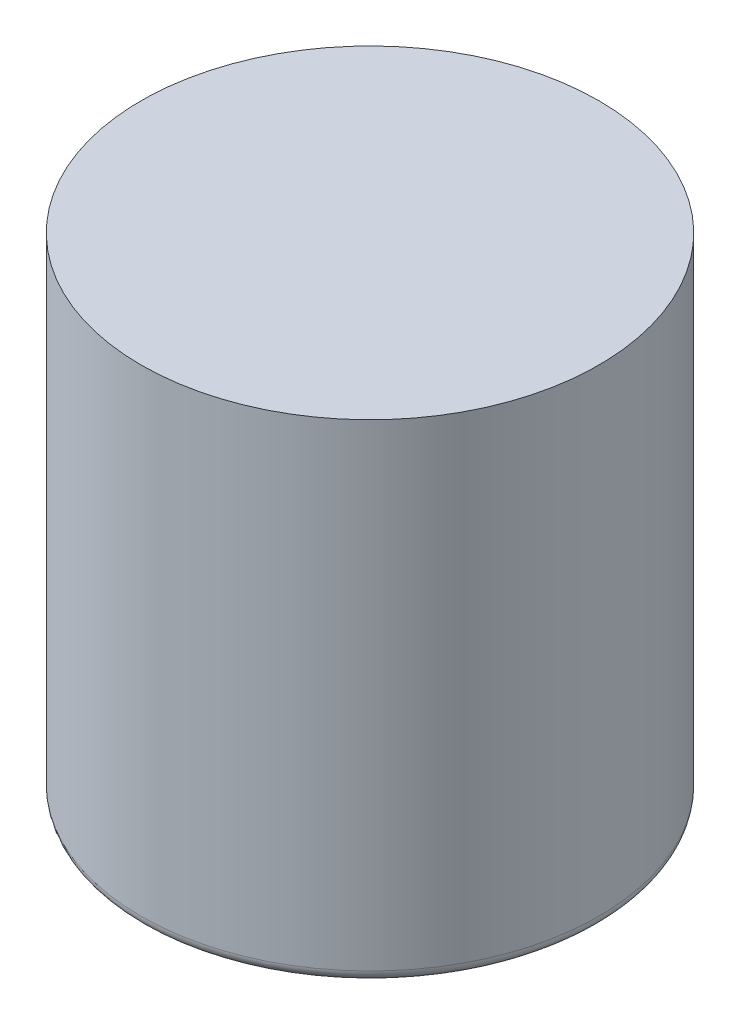
ISO-10303-21;
HEADER;
FILE_DESCRIPTION(('STEP AP214'),'2;1');
FILE_NAME('part.step','',(''),(''),'','','');
FILE_SCHEMA(('AUTOMOTIVE_DESIGN { 1 0 10303 214 1 1 1 1 }'));
ENDSEC;
DATA;
#1=APPLICATION_CONTEXT('core data for automotive mechanical design processes');
#2=APPLICATION_PROTOCOL_DEFINITION('international standard','automotive_design',2000,#1);
#3=PRODUCT_CONTEXT('',#1,'mechanical');
#4=PRODUCT('Part','Part','',(#3));
#5=PRODUCT_RELATED_PRODUCT_CATEGORY('part','',(#4));
#6=PRODUCT_DEFINITION_FORMATION('','',#4);
#7=PRODUCT_DEFINITION_CONTEXT('part definition',#1,'design');
#8=PRODUCT_DEFINITION('design','',#6,#7);
#9=PRODUCT_DEFINITION_SHAPE('','',#8);
#10=(LENGTH_UNIT() NAMED_UNIT(*) SI_UNIT(.MILLI.,.METRE.));
#11=(NAMED_UNIT(*) PLANE_ANGLE_UNIT() SI_UNIT($,.RADIAN.));
#12=(NAMED_UNIT(*) SI_UNIT($,.STERADIAN.) SOLID_ANGLE_UNIT());
#13=UNCERTAINTY_MEASURE_WITH_UNIT(LENGTH_MEASURE(1.E-05),#10,'distance_accuracy_value','');
#14=(GEOMETRIC_REPRESENTATION_CONTEXT(3) GLOBAL_UNCERTAINTY_ASSIGNED_CONTEXT((#13)) GLOBAL_UNIT_ASSIGNED_CONTEXT((#10,
#11,#12)) REPRESENTATION_CONTEXT('',''));
#15=CARTESIAN_POINT('',(0.,0.,0.));
#16=DIRECTION('',(0.,0.,1.));
#17=DIRECTION('',(1.,0.,0.));
#18=AXIS2_PLACEMENT_3D('',#15,#16,#17);
#19=CARTESIAN_POINT('',(0.,125.,0.));
#20=DIRECTION('',(0.,-1.,0.));
#21=DIRECTION('',(0.,0.,-1.));
#22=AXIS2_PLACEMENT_3D('',#19,#20,#21);
#23=CYLINDRICAL_SURFACE('',#22,58.5);
#24=CARTESIAN_POINT('',(0.,3.,0.));
#25=DIRECTION('',(0.,1.,0.));
#26=DIRECTION('',(0.,0.,1.));
#27=AXIS2_PLACEMENT_3D('',#24,#25,#26);
#28=CIRCLE('',#27,58.5);
#29=CARTESIAN_POINT('',(0.,3.,58.5));
#30=VERTEX_POINT('',#29);
#31=EDGE_CURVE('E49',#30,#30,#28,.T.);
#32=ORIENTED_EDGE('',*,*,#31,.T.);
#33=EDGE_LOOP('',(#32));
#34=FACE_BOUND('',#33,.T.);
#35=CARTESIAN_POINT('',(0.,125.,0.));
#36=DIRECTION('',(0.,1.,0.));
#37=DIRECTION('',(0.,0.,1.));
#38=AXIS2_PLACEMENT_3D('',#35,#36,#37);
#39=CIRCLE('',#38,58.5);
#40=CARTESIAN_POINT('',(0.,125.,58.5));
#41=VERTEX_POINT('',#40);
#42=EDGE_CURVE('E54',#41,#41,#39,.T.);
#43=ORIENTED_EDGE('',*,*,#42,.F.);
#44=EDGE_LOOP('',(#43));
#45=FACE_BOUND('',#44,.T.);
#46=ADVANCED_FACE('F41',(#34,#45),#23,.T.);
#47=CARTESIAN_POINT('',(0.,125.,0.));
#48=DIRECTION('',(0.,1.,0.));
#49=DIRECTION('',(0.,0.,1.));
#50=AXIS2_PLACEMENT_3D('',#47,#48,#49);
#51=PLANE('',#50);
#52=ORIENTED_EDGE('',*,*,#42,.T.);
#53=EDGE_LOOP('',(#52));
#54=FACE_BOUND('',#53,.T.);
#55=ADVANCED_FACE('F62',(#54),#51,.T.);
#56=CARTESIAN_POINT('',(0.,0.,0.));
#57=DIRECTION('',(0.,1.,0.));
#58=DIRECTION('',(0.,0.,1.));
#59=AXIS2_PLACEMENT_3D('',#56,#57,#58);
#60=PLANE('',#59);
#61=CARTESIAN_POINT('',(0.,0.,0.));
#62=DIRECTION('',(0.,1.,0.));
#63=DIRECTION('',(0.,0.,1.));
#64=AXIS2_PLACEMENT_3D('',#61,#62,#63);
#65=CIRCLE('',#64,55.5);
#66=CARTESIAN_POINT('',(0.,0.,55.5));
#67=VERTEX_POINT('',#66);
#68=EDGE_CURVE('E10',#67,#67,#65,.F.);
#69=ORIENTED_EDGE('',*,*,#68,.T.);
#70=EDGE_LOOP('',(#69));
#71=FACE_BOUND('',#70,.T.);
#72=ADVANCED_FACE('F68',(#71),#60,.F.);
#73=CARTESIAN_POINT('',(0.,3.,0.));
#74=DIRECTION('',(0.,1.,0.));
#75=DIRECTION('',(0.,0.,1.));
#76=AXIS2_PLACEMENT_3D('',#73,#74,#75);
#77=TOROIDAL_SURFACE('',#76,55.5,3.);
#78=ORIENTED_EDGE('',*,*,#68,.F.);
#79=EDGE_LOOP('',(#78));
#80=FACE_BOUND('',#79,.T.);
#81=ORIENTED_EDGE('',*,*,#31,.F.);
#82=EDGE_LOOP('',(#81));
#83=FACE_BOUND('',#82,.T.);
#84=ADVANCED_FACE('F43',(#80,#83),#77,.T.);
#85=CLOSED_SHELL('',(#46,#55,#72,#84));
#86=MANIFOLD_SOLID_BREP('B2',#85);
#87=ADVANCED_BREP_SHAPE_REPRESENTATION('',(#18,#86),#14);
#88=SHAPE_DEFINITION_REPRESENTATION(#9,#87);
ENDSEC;
END-ISO-10303-21;
